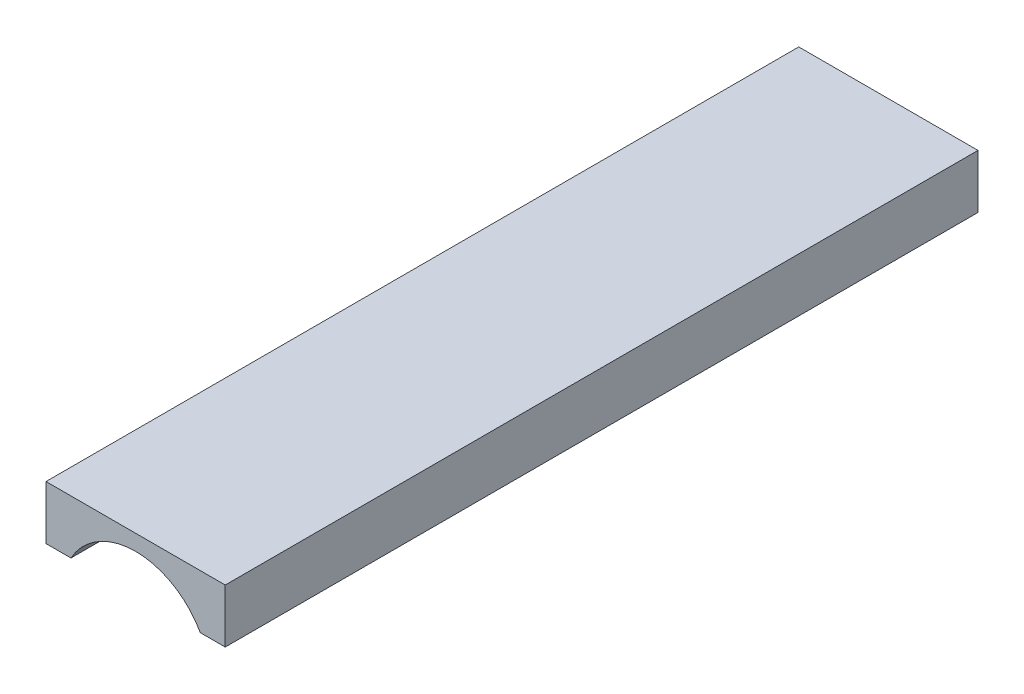
ISO-10303-21;
HEADER;
FILE_DESCRIPTION(('STEP AP214'),'2;1');
FILE_NAME('part.step','',(''),(''),'','','');
FILE_SCHEMA(('AUTOMOTIVE_DESIGN { 1 0 10303 214 1 1 1 1 }'));
ENDSEC;
DATA;
#1=APPLICATION_CONTEXT('core data for automotive mechanical design processes');
#2=APPLICATION_PROTOCOL_DEFINITION('international standard','automotive_design',2000,#1);
#3=PRODUCT_CONTEXT('',#1,'mechanical');
#4=PRODUCT('Part','Part','',(#3));
#5=PRODUCT_RELATED_PRODUCT_CATEGORY('part','',(#4));
#6=PRODUCT_DEFINITION_FORMATION('','',#4);
#7=PRODUCT_DEFINITION_CONTEXT('part definition',#1,'design');
#8=PRODUCT_DEFINITION('design','',#6,#7);
#9=PRODUCT_DEFINITION_SHAPE('','',#8);
#10=(LENGTH_UNIT() NAMED_UNIT(*) SI_UNIT(.MILLI.,.METRE.));
#11=(NAMED_UNIT(*) PLANE_ANGLE_UNIT() SI_UNIT($,.RADIAN.));
#12=(NAMED_UNIT(*) SI_UNIT($,.STERADIAN.) SOLID_ANGLE_UNIT());
#13=UNCERTAINTY_MEASURE_WITH_UNIT(LENGTH_MEASURE(1.E-05),#10,'distance_accuracy_value','');
#14=(GEOMETRIC_REPRESENTATION_CONTEXT(3) GLOBAL_UNCERTAINTY_ASSIGNED_CONTEXT((#13)) GLOBAL_UNIT_ASSIGNED_CONTEXT((#10,
#11,#12)) REPRESENTATION_CONTEXT('',''));
#15=CARTESIAN_POINT('',(0.,0.,0.));
#16=DIRECTION('',(0.,0.,1.));
#17=DIRECTION('',(1.,0.,0.));
#18=AXIS2_PLACEMENT_3D('',#15,#16,#17);
#19=CARTESIAN_POINT('',(0.,63.5,279.4));
#20=DIRECTION('',(0.,-1.,0.));
#21=DIRECTION('',(0.,0.,-1.));
#22=AXIS2_PLACEMENT_3D('',#19,#20,#21);
#23=PLANE('',#22);
#24=DIRECTION('',(1.,0.,0.));
#25=VECTOR('',#24,1.);
#26=CARTESIAN_POINT('',(-12.7,63.5,0.));
#27=LINE('',#26,#25);
#28=CARTESIAN_POINT('',(0.,63.5,0.));
#29=VERTEX_POINT('',#28);
#30=CARTESIAN_POINT('',(63.5,63.5,0.));
#31=VERTEX_POINT('',#30);
#32=EDGE_CURVE('E103',#29,#31,#27,.T.);
#33=ORIENTED_EDGE('',*,*,#32,.F.);
#34=DIRECTION('',(0.,0.,-1.));
#35=VECTOR('',#34,1.);
#36=CARTESIAN_POINT('',(0.,63.5,279.4));
#37=LINE('',#36,#35);
#38=CARTESIAN_POINT('',(0.,63.5,266.7));
#39=VERTEX_POINT('',#38);
#40=EDGE_CURVE('E44',#39,#29,#37,.T.);
#41=ORIENTED_EDGE('',*,*,#40,.F.);
#42=DIRECTION('',(-1.,0.,0.));
#43=VECTOR('',#42,1.);
#44=CARTESIAN_POINT('',(0.,63.5,266.7));
#45=LINE('',#44,#43);
#46=CARTESIAN_POINT('',(63.5,63.5,266.7));
#47=VERTEX_POINT('',#46);
#48=EDGE_CURVE('E123',#47,#39,#45,.T.);
#49=ORIENTED_EDGE('',*,*,#48,.F.);
#50=DIRECTION('',(0.,0.,-1.));
#51=VECTOR('',#50,1.);
#52=CARTESIAN_POINT('',(63.5,63.5,279.4));
#53=LINE('',#52,#51);
#54=EDGE_CURVE('E12',#47,#31,#53,.T.);
#55=ORIENTED_EDGE('',*,*,#54,.T.);
#56=EDGE_LOOP('',(#33,#41,#49,#55));
#57=FACE_BOUND('',#56,.T.);
#58=ADVANCED_FACE('F36',(#57),#23,.F.);
#59=CARTESIAN_POINT('',(63.5,0.,279.4));
#60=DIRECTION('',(-1.,0.,0.));
#61=DIRECTION('',(0.,-1.,0.));
#62=AXIS2_PLACEMENT_3D('',#59,#60,#61);
#63=PLANE('',#62);
#64=DIRECTION('',(0.,1.,0.));
#65=VECTOR('',#64,1.);
#66=CARTESIAN_POINT('',(63.5,63.5,0.));
#67=LINE('',#66,#65);
#68=CARTESIAN_POINT('',(63.5,44.45,0.));
#69=VERTEX_POINT('',#68);
#70=EDGE_CURVE('E100',#69,#31,#67,.T.);
#71=ORIENTED_EDGE('',*,*,#70,.T.);
#72=ORIENTED_EDGE('',*,*,#54,.F.);
#73=DIRECTION('',(0.,-1.,0.));
#74=VECTOR('',#73,1.);
#75=CARTESIAN_POINT('',(63.5,63.5,266.7));
#76=LINE('',#75,#74);
#77=CARTESIAN_POINT('',(63.5,44.45,266.7));
#78=VERTEX_POINT('',#77);
#79=EDGE_CURVE('E51',#47,#78,#76,.T.);
#80=ORIENTED_EDGE('',*,*,#79,.T.);
#81=DIRECTION('',(0.,0.,-1.));
#82=VECTOR('',#81,1.);
#83=CARTESIAN_POINT('',(63.5,44.45,266.7));
#84=LINE('',#83,#82);
#85=EDGE_CURVE('E91',#78,#69,#84,.T.);
#86=ORIENTED_EDGE('',*,*,#85,.T.);
#87=EDGE_LOOP('',(#71,#72,#80,#86));
#88=FACE_BOUND('',#87,.T.);
#89=ADVANCED_FACE('F106',(#88),#63,.F.);
#90=CARTESIAN_POINT('',(0.,0.,279.4));
#91=DIRECTION('',(1.,0.,0.));
#92=DIRECTION('',(0.,1.,0.));
#93=AXIS2_PLACEMENT_3D('',#90,#91,#92);
#94=PLANE('',#93);
#95=DIRECTION('',(0.,1.,0.));
#96=VECTOR('',#95,1.);
#97=CARTESIAN_POINT('',(0.,0.,0.));
#98=LINE('',#97,#96);
#99=CARTESIAN_POINT('',(0.,44.45,0.));
#100=VERTEX_POINT('',#99);
#101=EDGE_CURVE('E110',#100,#29,#98,.T.);
#102=ORIENTED_EDGE('',*,*,#101,.F.);
#103=DIRECTION('',(0.,0.,-1.));
#104=VECTOR('',#103,1.);
#105=CARTESIAN_POINT('',(0.,44.45,279.4));
#106=LINE('',#105,#104);
#107=CARTESIAN_POINT('',(0.,44.45,266.7));
#108=VERTEX_POINT('',#107);
#109=EDGE_CURVE('E118',#108,#100,#106,.T.);
#110=ORIENTED_EDGE('',*,*,#109,.F.);
#111=DIRECTION('',(0.,-1.,0.));
#112=VECTOR('',#111,1.);
#113=CARTESIAN_POINT('',(0.,0.,266.7));
#114=LINE('',#113,#112);
#115=EDGE_CURVE('E125',#39,#108,#114,.T.);
#116=ORIENTED_EDGE('',*,*,#115,.F.);
#117=ORIENTED_EDGE('',*,*,#40,.T.);
#118=EDGE_LOOP('',(#102,#110,#116,#117));
#119=FACE_BOUND('',#118,.T.);
#120=ADVANCED_FACE('F38',(#119),#94,.F.);
#121=CARTESIAN_POINT('',(-12.7,63.5,266.7));
#122=DIRECTION('',(0.,0.,1.));
#123=DIRECTION('',(1.,0.,0.));
#124=AXIS2_PLACEMENT_3D('',#121,#122,#123);
#125=PLANE('',#124);
#126=ORIENTED_EDGE('',*,*,#115,.T.);
#127=DIRECTION('',(1.,0.,0.));
#128=VECTOR('',#127,1.);
#129=CARTESIAN_POINT('',(-12.7,44.45,266.7));
#130=LINE('',#129,#128);
#131=CARTESIAN_POINT('',(8.84099436766186,44.45,266.7));
#132=VERTEX_POINT('',#131);
#133=EDGE_CURVE('E97',#108,#132,#130,.T.);
#134=ORIENTED_EDGE('',*,*,#133,.T.);
#135=CARTESIAN_POINT('',(31.75,31.75,266.7));
#136=DIRECTION('',(0.,0.,1.));
#137=DIRECTION('',(1.,0.,0.));
#138=AXIS2_PLACEMENT_3D('',#135,#136,#137);
#139=CIRCLE('',#138,26.19375);
#140=CARTESIAN_POINT('',(54.6590056323381,44.45,266.7));
#141=VERTEX_POINT('',#140);
#142=EDGE_CURVE('E120',#141,#132,#139,.T.);
#143=ORIENTED_EDGE('',*,*,#142,.F.);
#144=EDGE_CURVE('E58',#141,#78,#130,.T.);
#145=ORIENTED_EDGE('',*,*,#144,.T.);
#146=ORIENTED_EDGE('',*,*,#79,.F.);
#147=ORIENTED_EDGE('',*,*,#48,.T.);
#148=EDGE_LOOP('',(#126,#134,#143,#145,#146,#147));
#149=FACE_BOUND('',#148,.T.);
#150=ADVANCED_FACE('F136',(#149),#125,.T.);
#151=CARTESIAN_POINT('',(-12.7,44.45,266.7));
#152=DIRECTION('',(0.,-1.,0.));
#153=DIRECTION('',(1.,0.,0.));
#154=AXIS2_PLACEMENT_3D('',#151,#152,#153);
#155=PLANE('',#154);
#156=ORIENTED_EDGE('',*,*,#109,.T.);
#157=DIRECTION('',(1.,0.,0.));
#158=VECTOR('',#157,1.);
#159=CARTESIAN_POINT('',(-12.7,44.45,0.));
#160=LINE('',#159,#158);
#161=CARTESIAN_POINT('',(8.84099436766186,44.45,0.));
#162=VERTEX_POINT('',#161);
#163=EDGE_CURVE('E96',#100,#162,#160,.T.);
#164=ORIENTED_EDGE('',*,*,#163,.T.);
#165=DIRECTION('',(0.,0.,-1.));
#166=VECTOR('',#165,1.);
#167=CARTESIAN_POINT('',(8.84099436766187,44.45,279.4));
#168=LINE('',#167,#166);
#169=EDGE_CURVE('E115',#132,#162,#168,.T.);
#170=ORIENTED_EDGE('',*,*,#169,.F.);
#171=ORIENTED_EDGE('',*,*,#133,.F.);
#172=EDGE_LOOP('',(#156,#164,#170,#171));
#173=FACE_BOUND('',#172,.T.);
#174=ADVANCED_FACE('F140',(#173),#155,.T.);
#175=CARTESIAN_POINT('',(-12.7,63.5,0.));
#176=DIRECTION('',(0.,0.,-1.));
#177=DIRECTION('',(-1.,0.,0.));
#178=AXIS2_PLACEMENT_3D('',#175,#176,#177);
#179=PLANE('',#178);
#180=ORIENTED_EDGE('',*,*,#101,.T.);
#181=ORIENTED_EDGE('',*,*,#32,.T.);
#182=ORIENTED_EDGE('',*,*,#70,.F.);
#183=CARTESIAN_POINT('',(54.6590056323381,44.45,0.));
#184=VERTEX_POINT('',#183);
#185=EDGE_CURVE('E87',#184,#69,#160,.T.);
#186=ORIENTED_EDGE('',*,*,#185,.F.);
#187=CARTESIAN_POINT('',(31.75,31.75,0.));
#188=DIRECTION('',(0.,0.,1.));
#189=DIRECTION('',(1.,0.,0.));
#190=AXIS2_PLACEMENT_3D('',#187,#188,#189);
#191=CIRCLE('',#190,26.19375);
#192=EDGE_CURVE('E127',#184,#162,#191,.T.);
#193=ORIENTED_EDGE('',*,*,#192,.T.);
#194=ORIENTED_EDGE('',*,*,#163,.F.);
#195=EDGE_LOOP('',(#180,#181,#182,#186,#193,#194));
#196=FACE_BOUND('',#195,.T.);
#197=ADVANCED_FACE('F101',(#196),#179,.T.);
#198=ORIENTED_EDGE('',*,*,#185,.T.);
#199=ORIENTED_EDGE('',*,*,#85,.F.);
#200=ORIENTED_EDGE('',*,*,#144,.F.);
#201=DIRECTION('',(0.,0.,-1.));
#202=VECTOR('',#201,1.);
#203=CARTESIAN_POINT('',(54.6590056323381,44.45,279.4));
#204=LINE('',#203,#202);
#205=EDGE_CURVE('E93',#184,#141,#204,.F.);
#206=ORIENTED_EDGE('',*,*,#205,.F.);
#207=EDGE_LOOP('',(#198,#199,#200,#206));
#208=FACE_BOUND('',#207,.T.);
#209=ADVANCED_FACE('F89',(#208),#155,.T.);
#210=CARTESIAN_POINT('',(31.75,31.75,279.4));
#211=DIRECTION('',(0.,0.,-1.));
#212=DIRECTION('',(-1.,0.,0.));
#213=AXIS2_PLACEMENT_3D('',#210,#211,#212);
#214=CYLINDRICAL_SURFACE('',#213,26.19375);
#215=ORIENTED_EDGE('',*,*,#142,.T.);
#216=ORIENTED_EDGE('',*,*,#169,.T.);
#217=ORIENTED_EDGE('',*,*,#192,.F.);
#218=ORIENTED_EDGE('',*,*,#205,.T.);
#219=EDGE_LOOP('',(#215,#216,#217,#218));
#220=FACE_BOUND('',#219,.T.);
#221=ADVANCED_FACE('F144',(#220),#214,.F.);
#222=CLOSED_SHELL('',(#58,#89,#120,#150,#174,#197,#209,#221));
#223=MANIFOLD_SOLID_BREP('B2',#222);
#224=ADVANCED_BREP_SHAPE_REPRESENTATION('',(#18,#223),#14);
#225=SHAPE_DEFINITION_REPRESENTATION(#9,#224);
ENDSEC;
END-ISO-10303-21;
